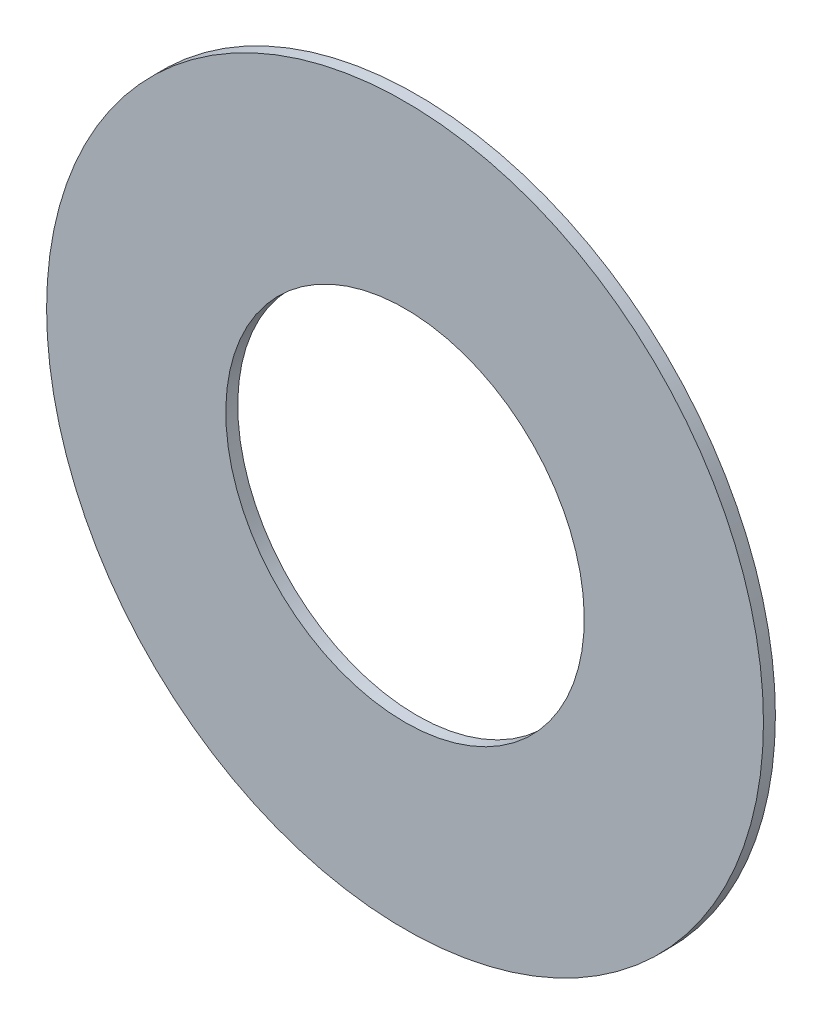
ISO-10303-21;
HEADER;
FILE_DESCRIPTION(('STEP AP214'),'2;1');
FILE_NAME('part.step','',(''),(''),'','','');
FILE_SCHEMA(('AUTOMOTIVE_DESIGN { 1 0 10303 214 1 1 1 1 }'));
ENDSEC;
DATA;
#1=APPLICATION_CONTEXT('core data for automotive mechanical design processes');
#2=APPLICATION_PROTOCOL_DEFINITION('international standard','automotive_design',2000,#1);
#3=PRODUCT_CONTEXT('',#1,'mechanical');
#4=PRODUCT('Part','Part','',(#3));
#5=PRODUCT_RELATED_PRODUCT_CATEGORY('part','',(#4));
#6=PRODUCT_DEFINITION_FORMATION('','',#4);
#7=PRODUCT_DEFINITION_CONTEXT('part definition',#1,'design');
#8=PRODUCT_DEFINITION('design','',#6,#7);
#9=PRODUCT_DEFINITION_SHAPE('','',#8);
#10=(LENGTH_UNIT() NAMED_UNIT(*) SI_UNIT(.MILLI.,.METRE.));
#11=(NAMED_UNIT(*) PLANE_ANGLE_UNIT() SI_UNIT($,.RADIAN.));
#12=(NAMED_UNIT(*) SI_UNIT($,.STERADIAN.) SOLID_ANGLE_UNIT());
#13=UNCERTAINTY_MEASURE_WITH_UNIT(LENGTH_MEASURE(1.E-05),#10,'distance_accuracy_value','');
#14=(GEOMETRIC_REPRESENTATION_CONTEXT(3) GLOBAL_UNCERTAINTY_ASSIGNED_CONTEXT((#13)) GLOBAL_UNIT_ASSIGNED_CONTEXT((#10,
#11,#12)) REPRESENTATION_CONTEXT('',''));
#15=CARTESIAN_POINT('',(0.,0.,0.));
#16=DIRECTION('',(0.,0.,1.));
#17=DIRECTION('',(1.,0.,0.));
#18=AXIS2_PLACEMENT_3D('',#15,#16,#17);
#19=CARTESIAN_POINT('',(136.902,-111.734,-0.045));
#20=DIRECTION('',(0.,0.,-1.));
#21=DIRECTION('',(0.,-1.,0.));
#22=AXIS2_PLACEMENT_3D('',#19,#20,#21);
#23=CYLINDRICAL_SURFACE('',#22,0.525);
#24=CARTESIAN_POINT('',(136.902,-111.734,-0.035));
#25=DIRECTION('',(0.,0.,-1.));
#26=DIRECTION('',(0.,-1.,0.));
#27=AXIS2_PLACEMENT_3D('',#24,#25,#26);
#28=CIRCLE('',#27,0.525);
#29=CARTESIAN_POINT('',(136.902,-112.259,-0.035));
#30=VERTEX_POINT('',#29);
#31=EDGE_CURVE('E26',#30,#30,#28,.T.);
#32=ORIENTED_EDGE('',*,*,#31,.T.);
#33=DIRECTION('',(0.,0.,1.));
#34=VECTOR('',#33,1.);
#35=CARTESIAN_POINT('',(136.902,-112.259,-0.045));
#36=LINE('',#35,#34);
#37=CARTESIAN_POINT('',(136.902,-112.259,0.));
#38=VERTEX_POINT('',#37);
#39=EDGE_CURVE('E11',#30,#38,#36,.T.);
#40=ORIENTED_EDGE('',*,*,#39,.T.);
#41=CARTESIAN_POINT('',(136.902,-111.734,0.));
#42=DIRECTION('',(0.,0.,-1.));
#43=DIRECTION('',(0.,-1.,0.));
#44=AXIS2_PLACEMENT_3D('',#41,#42,#43);
#45=CIRCLE('',#44,0.525);
#46=EDGE_CURVE('E68',#38,#38,#45,.T.);
#47=ORIENTED_EDGE('',*,*,#46,.F.);
#48=ORIENTED_EDGE('',*,*,#39,.F.);
#49=EDGE_LOOP('',(#32,#40,#47,#48));
#50=FACE_BOUND('',#49,.T.);
#51=ADVANCED_FACE('F17',(#50),#23,.F.);
#52=CARTESIAN_POINT('',(136.902,-111.734,-0.035));
#53=DIRECTION('',(0.,0.,1.));
#54=DIRECTION('',(1.,0.,0.));
#55=AXIS2_PLACEMENT_3D('',#52,#53,#54);
#56=PLANE('',#55);
#57=ORIENTED_EDGE('',*,*,#31,.F.);
#58=EDGE_LOOP('',(#57));
#59=FACE_BOUND('',#58,.T.);
#60=CARTESIAN_POINT('',(136.902,-111.734,-0.035));
#61=DIRECTION('',(0.,0.,1.));
#62=DIRECTION('',(1.,0.,0.));
#63=AXIS2_PLACEMENT_3D('',#60,#61,#62);
#64=CIRCLE('',#63,1.05);
#65=CARTESIAN_POINT('',(137.952,-111.734,-0.035));
#66=VERTEX_POINT('',#65);
#67=EDGE_CURVE('E57',#66,#66,#64,.T.);
#68=ORIENTED_EDGE('',*,*,#67,.F.);
#69=EDGE_LOOP('',(#68));
#70=FACE_BOUND('',#69,.T.);
#71=ADVANCED_FACE('F19',(#59,#70),#56,.F.);
#72=CARTESIAN_POINT('',(136.902,-111.734,0.));
#73=DIRECTION('',(0.,0.,1.));
#74=DIRECTION('',(1.,0.,0.));
#75=AXIS2_PLACEMENT_3D('',#72,#73,#74);
#76=PLANE('',#75);
#77=ORIENTED_EDGE('',*,*,#46,.T.);
#78=EDGE_LOOP('',(#77));
#79=FACE_BOUND('',#78,.T.);
#80=CARTESIAN_POINT('',(136.902,-111.734,0.));
#81=DIRECTION('',(0.,0.,1.));
#82=DIRECTION('',(1.,0.,0.));
#83=AXIS2_PLACEMENT_3D('',#80,#81,#82);
#84=CIRCLE('',#83,1.05);
#85=CARTESIAN_POINT('',(137.952,-111.734,0.));
#86=VERTEX_POINT('',#85);
#87=EDGE_CURVE('E55',#86,#86,#84,.T.);
#88=ORIENTED_EDGE('',*,*,#87,.T.);
#89=EDGE_LOOP('',(#88));
#90=FACE_BOUND('',#89,.T.);
#91=ADVANCED_FACE('F61',(#79,#90),#76,.T.);
#92=CARTESIAN_POINT('',(136.902,-111.734,-0.035));
#93=DIRECTION('',(0.,0.,1.));
#94=DIRECTION('',(1.,0.,0.));
#95=AXIS2_PLACEMENT_3D('',#92,#93,#94);
#96=CYLINDRICAL_SURFACE('',#95,1.05);
#97=ORIENTED_EDGE('',*,*,#87,.F.);
#98=DIRECTION('',(0.,0.,1.));
#99=VECTOR('',#98,1.);
#100=CARTESIAN_POINT('',(137.952,-111.734,-0.035));
#101=LINE('',#100,#99);
#102=EDGE_CURVE('E52',#66,#86,#101,.T.);
#103=ORIENTED_EDGE('',*,*,#102,.F.);
#104=ORIENTED_EDGE('',*,*,#67,.T.);
#105=ORIENTED_EDGE('',*,*,#102,.T.);
#106=EDGE_LOOP('',(#97,#103,#104,#105));
#107=FACE_BOUND('',#106,.T.);
#108=ADVANCED_FACE('F54',(#107),#96,.T.);
#109=CLOSED_SHELL('',(#51,#71,#91,#108));
#110=MANIFOLD_SOLID_BREP('B1',#109);
#111=ADVANCED_BREP_SHAPE_REPRESENTATION('',(#18,#110),#14);
#112=SHAPE_DEFINITION_REPRESENTATION(#9,#111);
ENDSEC;
END-ISO-10303-21;
